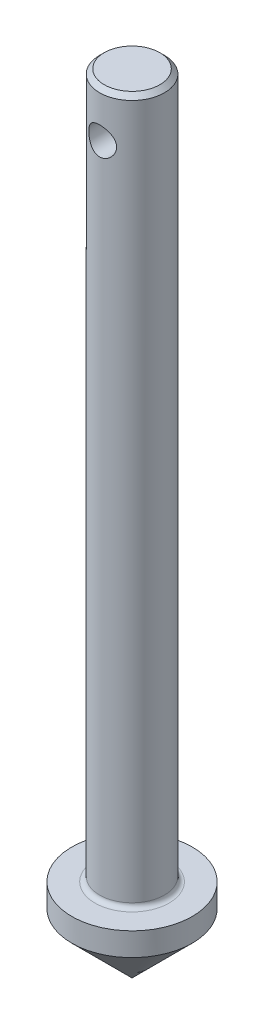
ISO-10303-21;
HEADER;
FILE_DESCRIPTION(('STEP AP214'),'2;1');
FILE_NAME('part.step','',(''),(''),'','','');
FILE_SCHEMA(('AUTOMOTIVE_DESIGN { 1 0 10303 214 1 1 1 1 }'));
ENDSEC;
DATA;
#1=APPLICATION_CONTEXT('core data for automotive mechanical design processes');
#2=APPLICATION_PROTOCOL_DEFINITION('international standard','automotive_design',2000,#1);
#3=PRODUCT_CONTEXT('',#1,'mechanical');
#4=PRODUCT('Part','Part','',(#3));
#5=PRODUCT_RELATED_PRODUCT_CATEGORY('part','',(#4));
#6=PRODUCT_DEFINITION_FORMATION('','',#4);
#7=PRODUCT_DEFINITION_CONTEXT('part definition',#1,'design');
#8=PRODUCT_DEFINITION('design','',#6,#7);
#9=PRODUCT_DEFINITION_SHAPE('','',#8);
#10=(LENGTH_UNIT() NAMED_UNIT(*) SI_UNIT(.MILLI.,.METRE.));
#11=(NAMED_UNIT(*) PLANE_ANGLE_UNIT() SI_UNIT($,.RADIAN.));
#12=(NAMED_UNIT(*) SI_UNIT($,.STERADIAN.) SOLID_ANGLE_UNIT());
#13=UNCERTAINTY_MEASURE_WITH_UNIT(LENGTH_MEASURE(1.E-05),#10,'distance_accuracy_value','');
#14=(GEOMETRIC_REPRESENTATION_CONTEXT(3) GLOBAL_UNCERTAINTY_ASSIGNED_CONTEXT((#13)) GLOBAL_UNIT_ASSIGNED_CONTEXT((#10,
#11,#12)) REPRESENTATION_CONTEXT('',''));
#15=CARTESIAN_POINT('',(0.,0.,0.));
#16=DIRECTION('',(0.,0.,1.));
#17=DIRECTION('',(1.,0.,0.));
#18=AXIS2_PLACEMENT_3D('',#15,#16,#17);
#19=CARTESIAN_POINT('',(0.,0.,0.));
#20=DIRECTION('',(0.,1.,0.));
#21=DIRECTION('',(0.,0.,1.));
#22=AXIS2_PLACEMENT_3D('',#19,#20,#21);
#23=CONICAL_SURFACE('',#22,0.,0.785398163397446);
#24=CARTESIAN_POINT('',(0.,6.5,0.));
#25=DIRECTION('',(0.,-1.,0.));
#26=DIRECTION('',(0.,0.,-1.));
#27=AXIS2_PLACEMENT_3D('',#24,#25,#26);
#28=CIRCLE('',#27,6.49999999999998);
#29=CARTESIAN_POINT('',(0.,6.5,-6.49999999999998));
#30=VERTEX_POINT('',#29);
#31=EDGE_CURVE('E147',#30,#30,#28,.T.);
#32=ORIENTED_EDGE('',*,*,#31,.T.);
#33=EDGE_LOOP('',(#32));
#34=FACE_BOUND('',#33,.T.);
#35=CARTESIAN_POINT('',(0.,0.,0.));
#36=VERTEX_POINT('',#35);
#37=VERTEX_LOOP('',#36);
#38=FACE_BOUND('',#37,.T.);
#39=ADVANCED_FACE('F57',(#34,#38),#23,.T.);
#40=CARTESIAN_POINT('',(0.,0.,0.));
#41=DIRECTION('',(0.,-1.,0.));
#42=DIRECTION('',(0.,0.,-1.));
#43=AXIS2_PLACEMENT_3D('',#40,#41,#42);
#44=CYLINDRICAL_SURFACE('',#43,6.49999999999998);
#45=CARTESIAN_POINT('',(0.,9.,0.));
#46=DIRECTION('',(0.,-1.,0.));
#47=DIRECTION('',(0.,0.,-1.));
#48=AXIS2_PLACEMENT_3D('',#45,#46,#47);
#49=CIRCLE('',#48,6.49999999999998);
#50=CARTESIAN_POINT('',(0.,9.,-6.49999999999998));
#51=VERTEX_POINT('',#50);
#52=EDGE_CURVE('E141',#51,#51,#49,.T.);
#53=ORIENTED_EDGE('',*,*,#52,.T.);
#54=EDGE_LOOP('',(#53));
#55=FACE_BOUND('',#54,.T.);
#56=ORIENTED_EDGE('',*,*,#31,.F.);
#57=EDGE_LOOP('',(#56));
#58=FACE_BOUND('',#57,.T.);
#59=ADVANCED_FACE('F70',(#55,#58),#44,.T.);
#60=CARTESIAN_POINT('',(6.49999999999998,9.,0.));
#61=DIRECTION('',(0.,1.,0.));
#62=DIRECTION('',(0.,0.,1.));
#63=AXIS2_PLACEMENT_3D('',#60,#61,#62);
#64=PLANE('',#63);
#65=CARTESIAN_POINT('',(0.,9.,0.));
#66=DIRECTION('',(0.,-1.,0.));
#67=DIRECTION('',(0.,0.,-1.));
#68=AXIS2_PLACEMENT_3D('',#65,#66,#67);
#69=CIRCLE('',#68,4.);
#70=CARTESIAN_POINT('',(0.,9.,-4.));
#71=VERTEX_POINT('',#70);
#72=EDGE_CURVE('E135',#71,#71,#69,.T.);
#73=ORIENTED_EDGE('',*,*,#72,.T.);
#74=EDGE_LOOP('',(#73));
#75=FACE_BOUND('',#74,.T.);
#76=ORIENTED_EDGE('',*,*,#52,.F.);
#77=EDGE_LOOP('',(#76));
#78=FACE_BOUND('',#77,.T.);
#79=ADVANCED_FACE('F75',(#75,#78),#64,.T.);
#80=CARTESIAN_POINT('',(0.,9.5,0.));
#81=DIRECTION('',(0.,-1.,0.));
#82=DIRECTION('',(0.,0.,-1.));
#83=AXIS2_PLACEMENT_3D('',#80,#81,#82);
#84=TOROIDAL_SURFACE('',#83,4.,0.500000000000003);
#85=CARTESIAN_POINT('',(0.,9.5,0.));
#86=DIRECTION('',(0.,-1.,0.));
#87=DIRECTION('',(0.,0.,-1.));
#88=AXIS2_PLACEMENT_3D('',#85,#86,#87);
#89=CIRCLE('',#88,3.5);
#90=CARTESIAN_POINT('',(0.,9.5,-3.5));
#91=VERTEX_POINT('',#90);
#92=EDGE_CURVE('E108',#91,#91,#89,.T.);
#93=ORIENTED_EDGE('',*,*,#92,.T.);
#94=EDGE_LOOP('',(#93));
#95=FACE_BOUND('',#94,.T.);
#96=ORIENTED_EDGE('',*,*,#72,.F.);
#97=EDGE_LOOP('',(#96));
#98=FACE_BOUND('',#97,.T.);
#99=ADVANCED_FACE('F82',(#95,#98),#84,.F.);
#100=CARTESIAN_POINT('',(0.,0.,0.));
#101=DIRECTION('',(0.,-1.,0.));
#102=DIRECTION('',(0.,0.,-1.));
#103=AXIS2_PLACEMENT_3D('',#100,#101,#102);
#104=CYLINDRICAL_SURFACE('',#103,3.5);
#105=CARTESIAN_POINT('',(0.,84.5,0.));
#106=DIRECTION('',(0.,1.,0.));
#107=DIRECTION('',(0.,0.,1.));
#108=AXIS2_PLACEMENT_3D('',#105,#106,#107);
#109=CIRCLE('',#108,3.5);
#110=CARTESIAN_POINT('',(0.,84.5,3.5));
#111=VERTEX_POINT('',#110);
#112=EDGE_CURVE('E66',#111,#111,#109,.F.);
#113=ORIENTED_EDGE('',*,*,#112,.T.);
#114=EDGE_LOOP('',(#113));
#115=FACE_BOUND('',#114,.T.);
#116=CARTESIAN_POINT('',(0.,81.5,-3.5));
#117=CARTESIAN_POINT('',(0.0801521976824072,81.499990778561,-3.49999299268884));
#118=CARTESIAN_POINT('',(0.160419992198247,81.4935378702444,-3.4972151640971));
#119=CARTESIAN_POINT('',(0.318671611361218,81.4679602927146,-3.48637069204865));
#120=CARTESIAN_POINT('',(0.396649149090579,81.4488036302104,-3.47829069608751));
#121=CARTESIAN_POINT('',(0.547768164746416,81.398664724801,-3.45770786336707));
#122=CARTESIAN_POINT('',(0.620925386146745,81.3677234725373,-3.44522036823866));
#123=CARTESIAN_POINT('',(0.760936446071895,81.2950678962495,-3.41702837926819));
#124=CARTESIAN_POINT('',(0.827791985611422,81.253356490849,-3.40132475720839));
#125=CARTESIAN_POINT('',(0.95692078354613,81.1580361458747,-3.36733908702934));
#126=CARTESIAN_POINT('',(1.01882024425247,81.1039523619224,-3.34896947381213));
#127=CARTESIAN_POINT('',(1.13299518436931,80.9864280738838,-3.3120882776969));
#128=CARTESIAN_POINT('',(1.18526532055665,80.9229824099297,-3.29357662187921));
#129=CARTESIAN_POINT('',(1.28142843548186,80.7844836362935,-3.25741027462363));
#130=CARTESIAN_POINT('',(1.32473406006015,80.7089947703575,-3.23985230076501));
#131=CARTESIAN_POINT('',(1.39786599574425,80.550945286533,-3.20898084363449));
#132=CARTESIAN_POINT('',(1.42769964537364,80.4683885479199,-3.19566505070703));
#133=CARTESIAN_POINT('',(1.47147459991437,80.3028496306905,-3.17573899533535));
#134=CARTESIAN_POINT('',(1.48613747209695,80.2200961490726,-3.16882610719817));
#135=CARTESIAN_POINT('',(1.50140303570396,80.0530370152324,-3.16162424842019));
#136=CARTESIAN_POINT('',(1.50201414304565,79.9687323223501,-3.16133131294301));
#137=CARTESIAN_POINT('',(1.48969999758096,79.8083500481512,-3.16714786968021));
#138=CARTESIAN_POINT('',(1.47788056910827,79.7321646883937,-3.17273435527608));
#139=CARTESIAN_POINT('',(1.44290386406528,79.582986207111,-3.18879205821456));
#140=CARTESIAN_POINT('',(1.41974426417223,79.5099937430712,-3.19926427650311));
#141=CARTESIAN_POINT('',(1.36228829534658,79.3673764242622,-3.22415342810443));
#142=CARTESIAN_POINT('',(1.32775987214029,79.2978598528855,-3.23865147551048));
#143=CARTESIAN_POINT('',(1.24871152436692,79.1653268379707,-3.26994246945713));
#144=CARTESIAN_POINT('',(1.20418753740296,79.1023130525368,-3.28673634798109));
#145=CARTESIAN_POINT('',(1.10171702696058,78.9786112481877,-3.32256202266195));
#146=CARTESIAN_POINT('',(1.04292364428051,78.9186416352636,-3.34165927694226));
#147=CARTESIAN_POINT('',(0.915936662025528,78.8091642046725,-3.3786730287964));
#148=CARTESIAN_POINT('',(0.847740608139985,78.759659127061,-3.39658921627429));
#149=CARTESIAN_POINT('',(0.701592911506314,78.6713780335964,-3.4297984684468));
#150=CARTESIAN_POINT('',(0.623435574851146,78.6329104906472,-3.44501227516835));
#151=CARTESIAN_POINT('',(0.460939847079478,78.5699248811927,-3.47048698130307));
#152=CARTESIAN_POINT('',(0.376605107828833,78.5453986470112,-3.48075078019997));
#153=CARTESIAN_POINT('',(0.210138119470685,78.5125330697705,-3.49461763446686));
#154=CARTESIAN_POINT('',(0.12822898050547,78.5032306173428,-3.49861624982293));
#155=CARTESIAN_POINT('',(-0.0360716505592627,78.4981852117959,-3.50077708325871));
#156=CARTESIAN_POINT('',(-0.118462985950312,78.5024380737338,-3.49894110265833));
#157=CARTESIAN_POINT('',(-0.276771219813308,78.5237078160274,-3.48989338160075));
#158=CARTESIAN_POINT('',(-0.352799465751999,78.5400341607242,-3.48297259736823));
#159=CARTESIAN_POINT('',(-0.500945568196327,78.584010447119,-3.46476944004986));
#160=CARTESIAN_POINT('',(-0.573062936850434,78.6116617978609,-3.45348652424256));
#161=CARTESIAN_POINT('',(-0.713888482619007,78.6784005797512,-3.42719375756864));
#162=CARTESIAN_POINT('',(-0.782419874757535,78.7178181651136,-3.41207852694255));
#163=CARTESIAN_POINT('',(-0.912142452825182,78.8066094722374,-3.37971494195701));
#164=CARTESIAN_POINT('',(-0.973330487571138,78.8559874440094,-3.36246567824312));
#165=CARTESIAN_POINT('',(-1.09148379765635,78.9676447939238,-3.32607394349023));
#166=CARTESIAN_POINT('',(-1.1477830877428,79.0306161050399,-3.30688677499572));
#167=CARTESIAN_POINT('',(-1.24921715724403,79.1653911493066,-3.26992018844849));
#168=CARTESIAN_POINT('',(-1.29434883220193,79.237197330153,-3.25214116277359));
#169=CARTESIAN_POINT('',(-1.37281937806385,79.3894069265143,-3.21981484643715));
#170=CARTESIAN_POINT('',(-1.40593207473354,79.4699415046568,-3.20533127997694));
#171=CARTESIAN_POINT('',(-1.45782942550893,79.636263163238,-3.18206803761103));
#172=CARTESIAN_POINT('',(-1.47662682249981,79.7220454986706,-3.17328328988834));
#173=CARTESIAN_POINT('',(-1.49805974083904,79.8889955866186,-3.16321740581935));
#174=CARTESIAN_POINT('',(-1.50187346166243,79.9699796353798,-3.1613896288168));
#175=CARTESIAN_POINT('',(-1.49641325085791,80.1313948718315,-3.16397809086751));
#176=CARTESIAN_POINT('',(-1.48714162748686,80.2118261545153,-3.16839322866983));
#177=CARTESIAN_POINT('',(-1.45678214099437,80.3655208538662,-3.1824582711803));
#178=CARTESIAN_POINT('',(-1.43633482013379,80.4389394166473,-3.19182357178317));
#179=CARTESIAN_POINT('',(-1.38485117000436,80.5813103621741,-3.21449437287189));
#180=CARTESIAN_POINT('',(-1.35381183006239,80.6502614684533,-3.22780099349553));
#181=CARTESIAN_POINT('',(-1.27981602227022,80.7864104369083,-3.25787626150961));
#182=CARTESIAN_POINT('',(-1.23624027712768,80.8532348938202,-3.27480834339631));
#183=CARTESIAN_POINT('',(-1.13924888881305,80.9789908635309,-3.3097987990854));
#184=CARTESIAN_POINT('',(-1.08582952534293,81.037919377544,-3.32785759700647));
#185=CARTESIAN_POINT('',(-0.965671675541749,81.1510030973144,-3.36477750877144));
#186=CARTESIAN_POINT('',(-0.898214817981345,81.2044147338685,-3.38358948911939));
#187=CARTESIAN_POINT('',(-0.754612613706939,81.2992149266932,-3.41848089249468));
#188=CARTESIAN_POINT('',(-0.678463349382715,81.3405980317498,-3.43455907522587));
#189=CARTESIAN_POINT('',(-0.520626802896576,81.4093445695707,-3.46197513636854));
#190=CARTESIAN_POINT('',(-0.439036402858201,81.4369035299793,-3.47337868320289));
#191=CARTESIAN_POINT('',(-0.271925657404339,81.4776347147672,-3.49042295491408));
#192=CARTESIAN_POINT('',(-0.186418352711325,81.4908515096466,-3.49608152963086));
#193=CARTESIAN_POINT('',(-0.0670267606132181,81.498880510954,-3.49952115812385));
#194=CARTESIAN_POINT('',(-0.0335234910607501,81.5000038568478,-3.50000293079341));
#195=CARTESIAN_POINT('',(0.,81.5,-3.5));
#196=B_SPLINE_CURVE_WITH_KNOTS('',3,(#116,#117,#118,#119,#120,#121,#122,#123,#124,#125,#126,
#127,#128,#129,#130,#131,#132,#133,#134,#135,#136,#137,#138,#139,#140,#141,#142,#143,#144,#145,
#146,#147,#148,#149,#150,#151,#152,#153,#154,#155,#156,#157,#158,#159,#160,#161,#162,#163,#164,
#165,#166,#167,#168,#169,#170,#171,#172,#173,#174,#175,#176,#177,#178,#179,#180,#181,#182,#183,
#184,#185,#186,#187,#188,#189,#190,#191,#192,#193,#194,#195),.UNSPECIFIED.,.T.,.F.,(4,2,2,2,2,2,
2,2,2,2,2,2,2,2,2,2,2,2,2,2,2,2,2,2,2,2,2,2,2,2,2,2,2,2,2,2,2,2,2,4),(0.,0.240357161374425,
0.481321951711677,0.721456131375719,0.961525304807657,1.21311371779254,1.46484131710872,
1.72984780430032,1.99470976114133,2.2462971341405,2.49773382188957,2.72855360159807,
2.95942069041216,3.19532704432401,3.43132944942384,3.68854918859163,3.94583619550724,
4.20973622296859,4.47348148178613,4.71978673747256,4.96601595851026,5.19915597113059,
5.43232499957122,5.67277527577346,5.9133283678829,6.17201425189604,6.43077196675483,
6.69417345394933,6.9573401971295,7.19934244432577,7.44130200762143,7.67066022550942,
7.90008369050322,8.14372375039558,8.38745608120077,8.65042084666959,8.91350460007055,
9.17275427816965,9.43119596989053,9.53172485598109),.UNSPECIFIED.);
#197=CARTESIAN_POINT('',(0.,81.5,-3.5));
#198=VERTEX_POINT('',#197);
#199=EDGE_CURVE('E102',#198,#198,#196,.T.);
#200=ORIENTED_EDGE('',*,*,#199,.F.);
#201=EDGE_LOOP('',(#200));
#202=FACE_BOUND('',#201,.T.);
#203=CARTESIAN_POINT('',(1.5,80.,3.16227766016838));
#204=CARTESIAN_POINT('',(1.49999038492545,80.0797689330454,3.16228717298615));
#205=CARTESIAN_POINT('',(1.49359660659694,80.1596581416419,3.16534018013074));
#206=CARTESIAN_POINT('',(1.46827542593982,80.3171166630736,3.17716042981265));
#207=CARTESIAN_POINT('',(1.44931491353816,80.3946792801385,3.18594276667924));
#208=CARTESIAN_POINT('',(1.39974825661799,80.5449159417978,3.20802619745321));
#209=CARTESIAN_POINT('',(1.3691914561727,80.6176091853444,3.22130811955254));
#210=CARTESIAN_POINT('',(1.29744502147729,80.7568179294357,3.25086693275557));
#211=CARTESIAN_POINT('',(1.25625747429105,80.8233346390968,3.26714323581242));
#212=CARTESIAN_POINT('',(1.16151711863134,80.9527249156165,3.3020556513051));
#213=CARTESIAN_POINT('',(1.10737213961854,81.0151427308154,3.32077467653238));
#214=CARTESIAN_POINT('',(0.989495816865002,81.1303513324004,3.35778390832689));
#215=CARTESIAN_POINT('',(0.92576066842773,81.1831382794712,3.37607394135677));
#216=CARTESIAN_POINT('',(0.786887444118553,81.2799595046357,3.41118222051011));
#217=CARTESIAN_POINT('',(0.711357726755069,81.3234745951306,3.42789293367331));
#218=CARTESIAN_POINT('',(0.55320358114717,81.3969821142159,3.4569371087723));
#219=CARTESIAN_POINT('',(0.470582497238464,81.4269808759326,3.46927262014747));
#220=CARTESIAN_POINT('',(0.305382130945836,81.4709325105611,3.48758735586712));
#221=CARTESIAN_POINT('',(0.223047558846195,81.4856730324829,3.49387724164572));
#222=CARTESIAN_POINT('',(0.0568497000057618,81.5012413503944,3.50052462942354));
#223=CARTESIAN_POINT('',(-0.0270129128697439,81.5020751373782,3.50088468598068));
#224=CARTESIAN_POINT('',(-0.18813420759687,81.4902048756098,3.49581016618033));
#225=CARTESIAN_POINT('',(-0.265470719086089,81.4783681000255,3.49074679776828));
#226=CARTESIAN_POINT('',(-0.416935858912363,81.4429879656726,3.47591102813446));
#227=CARTESIAN_POINT('',(-0.491064249746496,81.4194437417866,3.46613827891648));
#228=CARTESIAN_POINT('',(-0.63537898534239,81.3610467051372,3.44263346664963));
#229=CARTESIAN_POINT('',(-0.705487647304968,81.3260263538252,3.42884310391306));
#230=CARTESIAN_POINT('',(-0.839017665141774,81.2458413223221,3.39863837501696));
#231=CARTESIAN_POINT('',(-0.90243660651251,81.2006729977342,3.38222306678434));
#232=CARTESIAN_POINT('',(-1.02577392003805,81.0975952466571,3.34696895152063));
#233=CARTESIAN_POINT('',(-1.08508648843664,81.0389905651044,3.32804069559209));
#234=CARTESIAN_POINT('',(-1.19331308888253,80.9126485841838,3.29078815665823));
#235=CARTESIAN_POINT('',(-1.24222263226406,80.8449073631261,3.27246413723674));
#236=CARTESIAN_POINT('',(-1.32993971380651,80.6991100627388,3.23783417736942));
#237=CARTESIAN_POINT('',(-1.36831384702014,80.620767927155,3.22162619167355));
#238=CARTESIAN_POINT('',(-1.43107385954865,80.4578554957209,3.19424697319981));
#239=CARTESIAN_POINT('',(-1.45547041320371,80.3732900083395,3.18307189830842));
#240=CARTESIAN_POINT('',(-1.48799335058117,80.2064136022164,3.16799275229804));
#241=CARTESIAN_POINT('',(-1.49710640039855,80.1243355097023,3.16364898851198));
#242=CARTESIAN_POINT('',(-1.50171565988816,79.9597255124399,3.16146494308516));
#243=CARTESIAN_POINT('',(-1.49721705457354,79.8771937924447,3.16362218505066));
#244=CARTESIAN_POINT('',(-1.47563239208818,79.7200687131297,3.17374071577831));
#245=CARTESIAN_POINT('',(-1.45944230541441,79.6453221298146,3.18128847435202));
#246=CARTESIAN_POINT('',(-1.41614006363835,79.4996772618147,3.20079786500709));
#247=CARTESIAN_POINT('',(-1.38902525529709,79.4287799167272,3.21276056926751));
#248=CARTESIAN_POINT('',(-1.32334189052693,79.289395054855,3.24038333624188));
#249=CARTESIAN_POINT('',(-1.28432659707742,79.2211463390907,3.25618154123646));
#250=CARTESIAN_POINT('',(-1.19638562157086,79.0918246472427,3.28950916992048));
#251=CARTESIAN_POINT('',(-1.14745548114547,79.0307549188948,3.3070393706057));
#252=CARTESIAN_POINT('',(-1.03605747720158,78.9119855372204,3.34369698282831));
#253=CARTESIAN_POINT('',(-0.972781802419174,78.8550423814143,3.36283055507213));
#254=CARTESIAN_POINT('',(-0.837142334524683,78.7524328813365,3.39913473749074));
#255=CARTESIAN_POINT('',(-0.764777632276179,78.7067676665062,3.41630515097051));
#256=CARTESIAN_POINT('',(-0.612290393672596,78.6279586551948,3.44690719585056));
#257=CARTESIAN_POINT('',(-0.532131490582579,78.5948774772241,3.46032004460384));
#258=CARTESIAN_POINT('',(-0.366659881518576,78.5429251005544,3.48173830246699));
#259=CARTESIAN_POINT('',(-0.281350477650404,78.5240448996245,3.48974713693762));
#260=CARTESIAN_POINT('',(-0.114740191834877,78.5022112711926,3.49904040627988));
#261=CARTESIAN_POINT('',(-0.0336030421543009,78.4981930943223,3.50077418524232));
#262=CARTESIAN_POINT('',(0.128169808807151,78.5032977547891,3.49858700907224));
#263=CARTESIAN_POINT('',(0.208805604242758,78.5124180449499,3.49466715001972));
#264=CARTESIAN_POINT('',(0.364022405138257,78.542776768471,3.48185611932799));
#265=CARTESIAN_POINT('',(0.438716867066027,78.5635269837098,3.47316550610207));
#266=CARTESIAN_POINT('',(0.583524431853922,78.6160080319218,3.45179100848821));
#267=CARTESIAN_POINT('',(0.653636688669971,78.647740885924,3.43910638916064));
#268=CARTESIAN_POINT('',(0.79082085538958,78.722895177912,3.41024047270082));
#269=CARTESIAN_POINT('',(0.857608099366118,78.7667838526132,3.39392604407178));
#270=CARTESIAN_POINT('',(0.983159576175429,78.8643399647292,3.35970811620735));
#271=CARTESIAN_POINT('',(1.0419206185,78.9180112711777,3.341803989688));
#272=CARTESIAN_POINT('',(1.15419921481671,79.0381955086094,3.30477972078024));
#273=CARTESIAN_POINT('',(1.20702595263291,79.1053580081201,3.28566570654981));
#274=CARTESIAN_POINT('',(1.30078077887623,79.2481592575422,3.24969238680823));
#275=CARTESIAN_POINT('',(1.34170194259386,79.3238029051032,3.23283439654742));
#276=CARTESIAN_POINT('',(1.41018371094568,79.4815735699153,3.20355631016088));
#277=CARTESIAN_POINT('',(1.43776832759537,79.5636886231351,3.19112824877803));
#278=CARTESIAN_POINT('',(1.47837340972956,79.7319551799155,3.17252771438391));
#279=CARTESIAN_POINT('',(1.49144272805064,79.8180921209533,3.16633426473114));
#280=CARTESIAN_POINT('',(1.49899243118201,79.9363988449217,3.16275406284903));
#281=CARTESIAN_POINT('',(1.50000383428566,79.9681898590904,3.16227386666053));
#282=CARTESIAN_POINT('',(1.5,80.,3.16227766016838));
#283=B_SPLINE_CURVE_WITH_KNOTS('',3,(#203,#204,#205,#206,#207,#208,#209,#210,#211,#212,#213,
#214,#215,#216,#217,#218,#219,#220,#221,#222,#223,#224,#225,#226,#227,#228,#229,#230,#231,#232,
#233,#234,#235,#236,#237,#238,#239,#240,#241,#242,#243,#244,#245,#246,#247,#248,#249,#250,#251,
#252,#253,#254,#255,#256,#257,#258,#259,#260,#261,#262,#263,#264,#265,#266,#267,#268,#269,#270,
#271,#272,#273,#274,#275,#276,#277,#278,#279,#280,#281,#282),.UNSPECIFIED.,.T.,.F.,(4,2,2,2,2,2,
2,2,2,2,2,2,2,2,2,2,2,2,2,2,2,2,2,2,2,2,2,2,2,2,2,2,2,2,2,2,2,2,2,4),(0.,0.239211516998634,
0.479055812925293,0.717890772651923,0.956678879115827,1.20974703533054,1.46291585698786,
1.72782087173741,1.99260163484399,2.24290515697656,2.49310084605822,2.72720452587285,
2.96132550725881,3.19902917219044,3.43681833943188,3.69219429883403,3.94768022455396,
4.21248245374587,4.47708218938959,4.72382987542101,4.97048358104407,5.20000580849601,
5.4295838126324,5.66914358774548,5.9088113247203,6.16934837221378,6.42991150089539,
6.69175474679388,6.95343186577333,7.19595274449671,7.43842661162275,7.67141114258535,
7.90443857025996,8.14809791325948,8.39185383353303,8.65331392763672,8.91492579368382,
9.17606486564863,9.43632235654433,9.53171478279884),.UNSPECIFIED.);
#284=CARTESIAN_POINT('',(1.5,80.,3.16227766016838));
#285=VERTEX_POINT('',#284);
#286=EDGE_CURVE('E96',#285,#285,#283,.T.);
#287=ORIENTED_EDGE('',*,*,#286,.F.);
#288=EDGE_LOOP('',(#287));
#289=FACE_BOUND('',#288,.T.);
#290=ORIENTED_EDGE('',*,*,#92,.F.);
#291=EDGE_LOOP('',(#290));
#292=FACE_BOUND('',#291,.T.);
#293=ADVANCED_FACE('F86',(#115,#202,#289,#292),#104,.T.);
#294=CARTESIAN_POINT('',(3.5,85.,0.));
#295=DIRECTION('',(0.,1.,0.));
#296=DIRECTION('',(0.,0.,1.));
#297=AXIS2_PLACEMENT_3D('',#294,#295,#296);
#298=PLANE('',#297);
#299=CARTESIAN_POINT('',(0.,85.,0.));
#300=DIRECTION('',(0.,1.,0.));
#301=DIRECTION('',(0.,0.,1.));
#302=AXIS2_PLACEMENT_3D('',#299,#300,#301);
#303=CIRCLE('',#302,2.99999999999996);
#304=CARTESIAN_POINT('',(0.,85.,2.99999999999996));
#305=VERTEX_POINT('',#304);
#306=EDGE_CURVE('E13',#305,#305,#303,.T.);
#307=ORIENTED_EDGE('',*,*,#306,.T.);
#308=EDGE_LOOP('',(#307));
#309=FACE_BOUND('',#308,.T.);
#310=ADVANCED_FACE('F91',(#309),#298,.T.);
#311=CARTESIAN_POINT('',(0.,80.,-6.49999999999998));
#312=DIRECTION('',(0.,0.,1.));
#313=DIRECTION('',(1.,0.,0.));
#314=AXIS2_PLACEMENT_3D('',#311,#312,#313);
#315=CYLINDRICAL_SURFACE('',#314,1.5);
#316=ORIENTED_EDGE('',*,*,#199,.T.);
#317=EDGE_LOOP('',(#316));
#318=FACE_BOUND('',#317,.T.);
#319=ORIENTED_EDGE('',*,*,#286,.T.);
#320=EDGE_LOOP('',(#319));
#321=FACE_BOUND('',#320,.T.);
#322=ADVANCED_FACE('F109',(#318,#321),#315,.F.);
#323=CARTESIAN_POINT('',(0.,84.5,0.));
#324=DIRECTION('',(0.,-1.,0.));
#325=DIRECTION('',(0.,0.,-1.));
#326=AXIS2_PLACEMENT_3D('',#323,#324,#325);
#327=CONICAL_SURFACE('',#326,3.5,0.785398163397445);
#328=ORIENTED_EDGE('',*,*,#306,.F.);
#329=EDGE_LOOP('',(#328));
#330=FACE_BOUND('',#329,.T.);
#331=ORIENTED_EDGE('',*,*,#112,.F.);
#332=EDGE_LOOP('',(#331));
#333=FACE_BOUND('',#332,.T.);
#334=ADVANCED_FACE('F60',(#330,#333),#327,.T.);
#335=CLOSED_SHELL('',(#39,#59,#79,#99,#293,#310,#322,#334));
#336=MANIFOLD_SOLID_BREP('B2',#335);
#337=ADVANCED_BREP_SHAPE_REPRESENTATION('',(#18,#336),#14);
#338=SHAPE_DEFINITION_REPRESENTATION(#9,#337);
ENDSEC;
END-ISO-10303-21;
